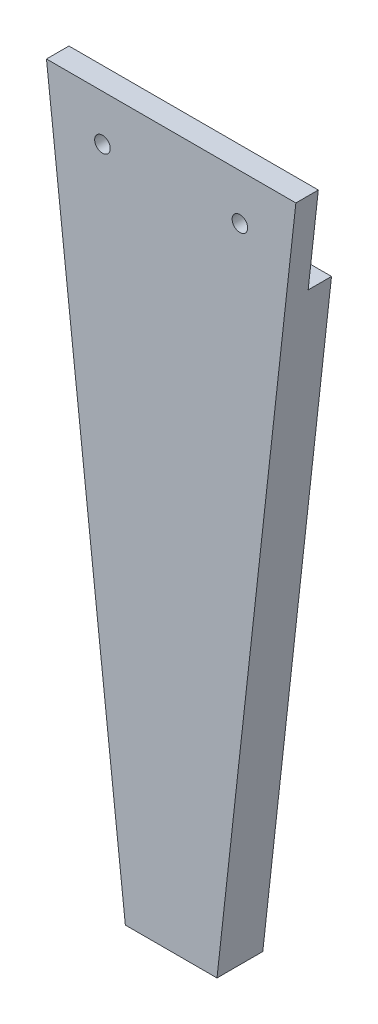
ISO-10303-21;
HEADER;
FILE_DESCRIPTION(('STEP AP214'),'2;1');
FILE_NAME('part.step','',(''),(''),'','','');
FILE_SCHEMA(('AUTOMOTIVE_DESIGN { 1 0 10303 214 1 1 1 1 }'));
ENDSEC;
DATA;
#1=APPLICATION_CONTEXT('core data for automotive mechanical design processes');
#2=APPLICATION_PROTOCOL_DEFINITION('international standard','automotive_design',2000,#1);
#3=PRODUCT_CONTEXT('',#1,'mechanical');
#4=PRODUCT('Part','Part','',(#3));
#5=PRODUCT_RELATED_PRODUCT_CATEGORY('part','',(#4));
#6=PRODUCT_DEFINITION_FORMATION('','',#4);
#7=PRODUCT_DEFINITION_CONTEXT('part definition',#1,'design');
#8=PRODUCT_DEFINITION('design','',#6,#7);
#9=PRODUCT_DEFINITION_SHAPE('','',#8);
#10=(LENGTH_UNIT() NAMED_UNIT(*) SI_UNIT(.MILLI.,.METRE.));
#11=(NAMED_UNIT(*) PLANE_ANGLE_UNIT() SI_UNIT($,.RADIAN.));
#12=(NAMED_UNIT(*) SI_UNIT($,.STERADIAN.) SOLID_ANGLE_UNIT());
#13=UNCERTAINTY_MEASURE_WITH_UNIT(LENGTH_MEASURE(1.E-05),#10,'distance_accuracy_value','');
#14=(GEOMETRIC_REPRESENTATION_CONTEXT(3) GLOBAL_UNCERTAINTY_ASSIGNED_CONTEXT((#13)) GLOBAL_UNIT_ASSIGNED_CONTEXT((#10,
#11,#12)) REPRESENTATION_CONTEXT('',''));
#15=CARTESIAN_POINT('',(0.,0.,0.));
#16=DIRECTION('',(0.,0.,1.));
#17=DIRECTION('',(1.,0.,0.));
#18=AXIS2_PLACEMENT_3D('',#15,#16,#17);
#19=CARTESIAN_POINT('',(24.6957239847835,-2.74122536231096,10.));
#20=DIRECTION('',(0.993895849368202,-0.11032243927987,0.));
#21=DIRECTION('',(0.11032243927987,0.993895849368202,0.));
#22=AXIS2_PLACEMENT_3D('',#19,#20,#21);
#23=PLANE('',#22);
#24=DIRECTION('',(-0.11032243927987,-0.993895849368202,0.));
#25=VECTOR('',#24,1.);
#26=CARTESIAN_POINT('',(24.6957239847835,-2.74122536231096,0.));
#27=LINE('',#26,#25);
#28=CARTESIAN_POINT('',(25.,0.,0.));
#29=VERTEX_POINT('',#28);
#30=CARTESIAN_POINT('',(10.,-135.135135135135,0.));
#31=VERTEX_POINT('',#30);
#32=EDGE_CURVE('E77',#29,#31,#27,.T.);
#33=ORIENTED_EDGE('',*,*,#32,.F.);
#34=DIRECTION('',(0.,0.,-1.));
#35=VECTOR('',#34,1.);
#36=CARTESIAN_POINT('',(25.,0.,5.1));
#37=LINE('',#36,#35);
#38=CARTESIAN_POINT('',(25.,0.,5.1));
#39=VERTEX_POINT('',#38);
#40=EDGE_CURVE('E53',#39,#29,#37,.T.);
#41=ORIENTED_EDGE('',*,*,#40,.F.);
#42=DIRECTION('',(0.11032243927987,0.993895849368202,0.));
#43=VECTOR('',#42,1.);
#44=CARTESIAN_POINT('',(24.6957239847835,-2.74122536231096,5.1));
#45=LINE('',#44,#43);
#46=CARTESIAN_POINT('',(27.22,20.,5.1));
#47=VERTEX_POINT('',#46);
#48=EDGE_CURVE('E141',#39,#47,#45,.T.);
#49=ORIENTED_EDGE('',*,*,#48,.T.);
#50=DIRECTION('',(0.,0.,-1.));
#51=VECTOR('',#50,1.);
#52=CARTESIAN_POINT('',(27.22,20.,10.));
#53=LINE('',#52,#51);
#54=CARTESIAN_POINT('',(27.22,20.,10.));
#55=VERTEX_POINT('',#54);
#56=EDGE_CURVE('E11',#55,#47,#53,.T.);
#57=ORIENTED_EDGE('',*,*,#56,.F.);
#58=DIRECTION('',(-0.11032243927987,-0.993895849368202,0.));
#59=VECTOR('',#58,1.);
#60=CARTESIAN_POINT('',(24.6957239847835,-2.74122536231096,10.));
#61=LINE('',#60,#59);
#62=CARTESIAN_POINT('',(10.,-135.135135135135,10.));
#63=VERTEX_POINT('',#62);
#64=EDGE_CURVE('E129',#55,#63,#61,.T.);
#65=ORIENTED_EDGE('',*,*,#64,.T.);
#66=DIRECTION('',(0.,0.,-1.));
#67=VECTOR('',#66,1.);
#68=CARTESIAN_POINT('',(10.,-135.135135135135,10.));
#69=LINE('',#68,#67);
#70=EDGE_CURVE('E122',#63,#31,#69,.T.);
#71=ORIENTED_EDGE('',*,*,#70,.T.);
#72=EDGE_LOOP('',(#33,#41,#49,#57,#65,#71));
#73=FACE_BOUND('',#72,.T.);
#74=ADVANCED_FACE('F39',(#73),#23,.T.);
#75=CARTESIAN_POINT('',(-24.6957239847835,-2.74122536231097,10.));
#76=DIRECTION('',(0.993895849368202,0.110322439279871,0.));
#77=DIRECTION('',(-0.110322439279871,0.993895849368202,0.));
#78=AXIS2_PLACEMENT_3D('',#75,#76,#77);
#79=PLANE('',#78);
#80=DIRECTION('',(0.,0.,-1.));
#81=VECTOR('',#80,1.);
#82=CARTESIAN_POINT('',(-25.,0.,5.1));
#83=LINE('',#82,#81);
#84=CARTESIAN_POINT('',(-25.,0.,5.1));
#85=VERTEX_POINT('',#84);
#86=CARTESIAN_POINT('',(-25.,0.,0.));
#87=VERTEX_POINT('',#86);
#88=EDGE_CURVE('E133',#85,#87,#83,.T.);
#89=ORIENTED_EDGE('',*,*,#88,.T.);
#90=DIRECTION('',(0.110322439279871,-0.993895849368202,0.));
#91=VECTOR('',#90,1.);
#92=CARTESIAN_POINT('',(-24.6957239847835,-2.74122536231097,0.));
#93=LINE('',#92,#91);
#94=CARTESIAN_POINT('',(-9.99999999999995,-135.135135135135,0.));
#95=VERTEX_POINT('',#94);
#96=EDGE_CURVE('E130',#87,#95,#93,.T.);
#97=ORIENTED_EDGE('',*,*,#96,.T.);
#98=DIRECTION('',(0.,0.,-1.));
#99=VECTOR('',#98,1.);
#100=CARTESIAN_POINT('',(-9.99999999999995,-135.135135135135,10.));
#101=LINE('',#100,#99);
#102=CARTESIAN_POINT('',(-9.99999999999995,-135.135135135135,10.));
#103=VERTEX_POINT('',#102);
#104=EDGE_CURVE('E120',#103,#95,#101,.T.);
#105=ORIENTED_EDGE('',*,*,#104,.F.);
#106=DIRECTION('',(0.110322439279871,-0.993895849368202,0.));
#107=VECTOR('',#106,1.);
#108=CARTESIAN_POINT('',(-24.6957239847835,-2.74122536231097,10.));
#109=LINE('',#108,#107);
#110=CARTESIAN_POINT('',(-27.22,20.,10.));
#111=VERTEX_POINT('',#110);
#112=EDGE_CURVE('E118',#111,#103,#109,.T.);
#113=ORIENTED_EDGE('',*,*,#112,.F.);
#114=DIRECTION('',(0.,0.,-1.));
#115=VECTOR('',#114,1.);
#116=CARTESIAN_POINT('',(-27.22,20.,10.));
#117=LINE('',#116,#115);
#118=CARTESIAN_POINT('',(-27.22,20.,5.1));
#119=VERTEX_POINT('',#118);
#120=EDGE_CURVE('E46',#111,#119,#117,.T.);
#121=ORIENTED_EDGE('',*,*,#120,.T.);
#122=DIRECTION('',(0.11032243927987,-0.993895849368202,0.));
#123=VECTOR('',#122,1.);
#124=CARTESIAN_POINT('',(-24.6957239847835,-2.74122536231096,5.1));
#125=LINE('',#124,#123);
#126=EDGE_CURVE('E100',#119,#85,#125,.T.);
#127=ORIENTED_EDGE('',*,*,#126,.T.);
#128=EDGE_LOOP('',(#89,#97,#105,#113,#121,#127));
#129=FACE_BOUND('',#128,.T.);
#130=ADVANCED_FACE('F116',(#129),#79,.F.);
#131=CARTESIAN_POINT('',(0.,0.,0.));
#132=DIRECTION('',(0.,0.,1.));
#133=DIRECTION('',(1.,0.,0.));
#134=AXIS2_PLACEMENT_3D('',#131,#132,#133);
#135=PLANE('',#134);
#136=DIRECTION('',(1.,0.,0.));
#137=VECTOR('',#136,1.);
#138=CARTESIAN_POINT('',(0.,0.,0.));
#139=LINE('',#138,#137);
#140=EDGE_CURVE('E114',#87,#29,#139,.T.);
#141=ORIENTED_EDGE('',*,*,#140,.T.);
#142=ORIENTED_EDGE('',*,*,#32,.T.);
#143=DIRECTION('',(1.,0.,0.));
#144=VECTOR('',#143,1.);
#145=CARTESIAN_POINT('',(0.,-135.135135135135,0.));
#146=LINE('',#145,#144);
#147=EDGE_CURVE('E126',#95,#31,#146,.T.);
#148=ORIENTED_EDGE('',*,*,#147,.F.);
#149=ORIENTED_EDGE('',*,*,#96,.F.);
#150=EDGE_LOOP('',(#141,#142,#148,#149));
#151=FACE_BOUND('',#150,.T.);
#152=ADVANCED_FACE('F179',(#151),#135,.F.);
#153=CARTESIAN_POINT('',(0.,20.,10.));
#154=DIRECTION('',(0.,1.,0.));
#155=DIRECTION('',(0.,0.,1.));
#156=AXIS2_PLACEMENT_3D('',#153,#154,#155);
#157=PLANE('',#156);
#158=DIRECTION('',(1.,0.,0.));
#159=VECTOR('',#158,1.);
#160=CARTESIAN_POINT('',(0.,20.,5.1));
#161=LINE('',#160,#159);
#162=EDGE_CURVE('E104',#119,#47,#161,.T.);
#163=ORIENTED_EDGE('',*,*,#162,.F.);
#164=ORIENTED_EDGE('',*,*,#120,.F.);
#165=DIRECTION('',(1.,0.,0.));
#166=VECTOR('',#165,1.);
#167=CARTESIAN_POINT('',(0.,20.,10.));
#168=LINE('',#167,#166);
#169=EDGE_CURVE('E136',#111,#55,#168,.T.);
#170=ORIENTED_EDGE('',*,*,#169,.T.);
#171=ORIENTED_EDGE('',*,*,#56,.T.);
#172=EDGE_LOOP('',(#163,#164,#170,#171));
#173=FACE_BOUND('',#172,.T.);
#174=ADVANCED_FACE('F111',(#173),#157,.T.);
#175=CARTESIAN_POINT('',(0.,-135.135135135135,10.));
#176=DIRECTION('',(0.,1.,0.));
#177=DIRECTION('',(-1.,0.,0.));
#178=AXIS2_PLACEMENT_3D('',#175,#176,#177);
#179=PLANE('',#178);
#180=ORIENTED_EDGE('',*,*,#147,.T.);
#181=ORIENTED_EDGE('',*,*,#70,.F.);
#182=DIRECTION('',(1.,0.,0.));
#183=VECTOR('',#182,1.);
#184=CARTESIAN_POINT('',(0.,-135.135135135135,10.));
#185=LINE('',#184,#183);
#186=EDGE_CURVE('E62',#103,#63,#185,.T.);
#187=ORIENTED_EDGE('',*,*,#186,.F.);
#188=ORIENTED_EDGE('',*,*,#104,.T.);
#189=EDGE_LOOP('',(#180,#181,#187,#188));
#190=FACE_BOUND('',#189,.T.);
#191=ADVANCED_FACE('F182',(#190),#179,.F.);
#192=CARTESIAN_POINT('',(0.,0.,10.));
#193=DIRECTION('',(0.,0.,1.));
#194=DIRECTION('',(1.,0.,0.));
#195=AXIS2_PLACEMENT_3D('',#192,#193,#194);
#196=PLANE('',#195);
#197=CARTESIAN_POINT('',(15.,10.,10.));
#198=DIRECTION('',(0.,0.,1.));
#199=DIRECTION('',(1.,0.,0.));
#200=AXIS2_PLACEMENT_3D('',#197,#198,#199);
#201=CIRCLE('',#200,1.7);
#202=CARTESIAN_POINT('',(16.7,10.,10.));
#203=VERTEX_POINT('',#202);
#204=EDGE_CURVE('E143',#203,#203,#201,.T.);
#205=ORIENTED_EDGE('',*,*,#204,.F.);
#206=EDGE_LOOP('',(#205));
#207=FACE_BOUND('',#206,.T.);
#208=CARTESIAN_POINT('',(-15.,10.,10.));
#209=DIRECTION('',(0.,0.,1.));
#210=DIRECTION('',(1.,0.,0.));
#211=AXIS2_PLACEMENT_3D('',#208,#209,#210);
#212=CIRCLE('',#211,1.7);
#213=CARTESIAN_POINT('',(-13.3,10.,10.));
#214=VERTEX_POINT('',#213);
#215=EDGE_CURVE('E148',#214,#214,#212,.T.);
#216=ORIENTED_EDGE('',*,*,#215,.F.);
#217=EDGE_LOOP('',(#216));
#218=FACE_BOUND('',#217,.T.);
#219=ORIENTED_EDGE('',*,*,#64,.F.);
#220=ORIENTED_EDGE('',*,*,#169,.F.);
#221=ORIENTED_EDGE('',*,*,#112,.T.);
#222=ORIENTED_EDGE('',*,*,#186,.T.);
#223=EDGE_LOOP('',(#219,#220,#221,#222));
#224=FACE_BOUND('',#223,.T.);
#225=ADVANCED_FACE('F185',(#207,#218,#224),#196,.T.);
#226=CARTESIAN_POINT('',(0.,0.,5.1));
#227=DIRECTION('',(0.,1.,0.));
#228=DIRECTION('',(-1.,0.,0.));
#229=AXIS2_PLACEMENT_3D('',#226,#227,#228);
#230=PLANE('',#229);
#231=ORIENTED_EDGE('',*,*,#140,.F.);
#232=ORIENTED_EDGE('',*,*,#88,.F.);
#233=DIRECTION('',(1.,0.,0.));
#234=VECTOR('',#233,1.);
#235=CARTESIAN_POINT('',(0.,0.,5.1));
#236=LINE('',#235,#234);
#237=EDGE_CURVE('E105',#85,#39,#236,.T.);
#238=ORIENTED_EDGE('',*,*,#237,.T.);
#239=ORIENTED_EDGE('',*,*,#40,.T.);
#240=EDGE_LOOP('',(#231,#232,#238,#239));
#241=FACE_BOUND('',#240,.T.);
#242=ADVANCED_FACE('F163',(#241),#230,.T.);
#243=CARTESIAN_POINT('',(0.,0.,5.1));
#244=DIRECTION('',(0.,0.,1.));
#245=DIRECTION('',(1.,0.,0.));
#246=AXIS2_PLACEMENT_3D('',#243,#244,#245);
#247=PLANE('',#246);
#248=CARTESIAN_POINT('',(15.,10.,5.1));
#249=DIRECTION('',(0.,0.,-1.));
#250=DIRECTION('',(-1.,0.,0.));
#251=AXIS2_PLACEMENT_3D('',#248,#249,#250);
#252=CIRCLE('',#251,1.7);
#253=CARTESIAN_POINT('',(13.3,10.,5.1));
#254=VERTEX_POINT('',#253);
#255=EDGE_CURVE('E151',#254,#254,#252,.T.);
#256=ORIENTED_EDGE('',*,*,#255,.F.);
#257=EDGE_LOOP('',(#256));
#258=FACE_BOUND('',#257,.T.);
#259=CARTESIAN_POINT('',(-15.,10.,5.1));
#260=DIRECTION('',(0.,0.,-1.));
#261=DIRECTION('',(1.,0.,0.));
#262=AXIS2_PLACEMENT_3D('',#259,#260,#261);
#263=CIRCLE('',#262,1.7);
#264=CARTESIAN_POINT('',(-13.3,10.,5.1));
#265=VERTEX_POINT('',#264);
#266=EDGE_CURVE('E152',#265,#265,#263,.T.);
#267=ORIENTED_EDGE('',*,*,#266,.F.);
#268=EDGE_LOOP('',(#267));
#269=FACE_BOUND('',#268,.T.);
#270=ORIENTED_EDGE('',*,*,#162,.T.);
#271=ORIENTED_EDGE('',*,*,#48,.F.);
#272=ORIENTED_EDGE('',*,*,#237,.F.);
#273=ORIENTED_EDGE('',*,*,#126,.F.);
#274=EDGE_LOOP('',(#270,#271,#272,#273));
#275=FACE_BOUND('',#274,.T.);
#276=ADVANCED_FACE('F102',(#258,#269,#275),#247,.F.);
#277=CARTESIAN_POINT('',(-15.,10.,10.2));
#278=DIRECTION('',(0.,0.,-1.));
#279=DIRECTION('',(-1.,0.,0.));
#280=AXIS2_PLACEMENT_3D('',#277,#278,#279);
#281=CYLINDRICAL_SURFACE('',#280,1.7);
#282=ORIENTED_EDGE('',*,*,#215,.T.);
#283=EDGE_LOOP('',(#282));
#284=FACE_BOUND('',#283,.T.);
#285=ORIENTED_EDGE('',*,*,#266,.T.);
#286=EDGE_LOOP('',(#285));
#287=FACE_BOUND('',#286,.T.);
#288=ADVANCED_FACE('F162',(#284,#287),#281,.F.);
#289=CARTESIAN_POINT('',(15.,10.,10.2));
#290=DIRECTION('',(0.,0.,-1.));
#291=DIRECTION('',(-1.,0.,0.));
#292=AXIS2_PLACEMENT_3D('',#289,#290,#291);
#293=CYLINDRICAL_SURFACE('',#292,1.7);
#294=ORIENTED_EDGE('',*,*,#204,.T.);
#295=EDGE_LOOP('',(#294));
#296=FACE_BOUND('',#295,.T.);
#297=ORIENTED_EDGE('',*,*,#255,.T.);
#298=EDGE_LOOP('',(#297));
#299=FACE_BOUND('',#298,.T.);
#300=ADVANCED_FACE('F158',(#296,#299),#293,.F.);
#301=CLOSED_SHELL('',(#74,#130,#152,#174,#191,#225,#242,#276,#288,#300));
#302=MANIFOLD_SOLID_BREP('B2',#301);
#303=ADVANCED_BREP_SHAPE_REPRESENTATION('',(#18,#302),#14);
#304=SHAPE_DEFINITION_REPRESENTATION(#9,#303);
ENDSEC;
END-ISO-10303-21;
